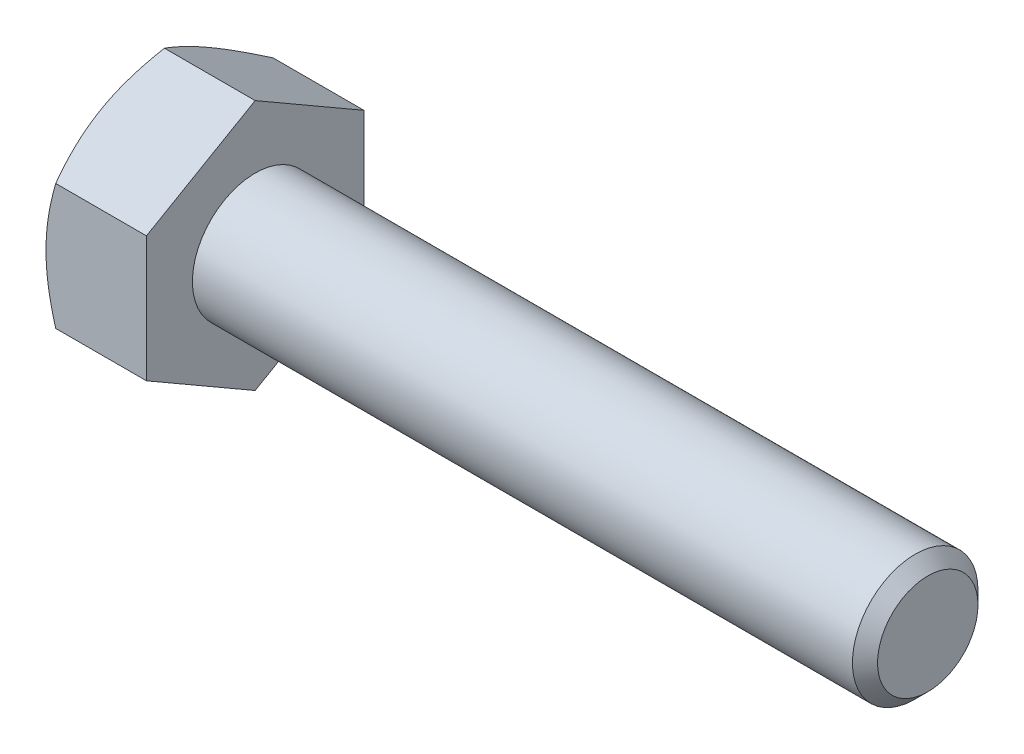
ISO-10303-21;
HEADER;
FILE_DESCRIPTION(('STEP AP214'),'2;1');
FILE_NAME('part.step','',(''),(''),'','','');
FILE_SCHEMA(('AUTOMOTIVE_DESIGN { 1 0 10303 214 1 1 1 1 }'));
ENDSEC;
DATA;
#1=APPLICATION_CONTEXT('core data for automotive mechanical design processes');
#2=APPLICATION_PROTOCOL_DEFINITION('international standard','automotive_design',2000,#1);
#3=PRODUCT_CONTEXT('',#1,'mechanical');
#4=PRODUCT('Part','Part','',(#3));
#5=PRODUCT_RELATED_PRODUCT_CATEGORY('part','',(#4));
#6=PRODUCT_DEFINITION_FORMATION('','',#4);
#7=PRODUCT_DEFINITION_CONTEXT('part definition',#1,'design');
#8=PRODUCT_DEFINITION('design','',#6,#7);
#9=PRODUCT_DEFINITION_SHAPE('','',#8);
#10=(LENGTH_UNIT() NAMED_UNIT(*) SI_UNIT(.MILLI.,.METRE.));
#11=(NAMED_UNIT(*) PLANE_ANGLE_UNIT() SI_UNIT($,.RADIAN.));
#12=(NAMED_UNIT(*) SI_UNIT($,.STERADIAN.) SOLID_ANGLE_UNIT());
#13=UNCERTAINTY_MEASURE_WITH_UNIT(LENGTH_MEASURE(1.E-05),#10,'distance_accuracy_value','');
#14=(GEOMETRIC_REPRESENTATION_CONTEXT(3) GLOBAL_UNCERTAINTY_ASSIGNED_CONTEXT((#13)) GLOBAL_UNIT_ASSIGNED_CONTEXT((#10,
#11,#12)) REPRESENTATION_CONTEXT('',''));
#15=CARTESIAN_POINT('',(0.,0.,0.));
#16=DIRECTION('',(0.,0.,1.));
#17=DIRECTION('',(1.,0.,0.));
#18=AXIS2_PLACEMENT_3D('',#15,#16,#17);
#19=CARTESIAN_POINT('',(-22.4,14.0000000000003,-24.2487113059641));
#20=DIRECTION('',(0.,0.866025403784442,-0.499999999999995));
#21=DIRECTION('',(0.,0.499999999999995,0.866025403784442));
#22=AXIS2_PLACEMENT_3D('',#19,#20,#21);
#23=PLANE('',#22);
#24=DIRECTION('',(1.,0.,0.));
#25=VECTOR('',#24,1.);
#26=CARTESIAN_POINT('',(-22.4,14.0000000000003,-24.2487113059641));
#27=LINE('',#26,#25);
#28=CARTESIAN_POINT('',(-20.2341924626905,14.0000000000003,-24.2487113059641));
#29=VERTEX_POINT('',#28);
#30=CARTESIAN_POINT('',(0.,14.0000000000003,-24.2487113059641));
#31=VERTEX_POINT('',#30);
#32=EDGE_CURVE('E252',#29,#31,#27,.T.);
#33=ORIENTED_EDGE('',*,*,#32,.F.);
#34=CARTESIAN_POINT('',(-20.2341257956115,13.9998845299464,-24.2489113059641));
#35=CARTESIAN_POINT('',(-20.4117715122077,14.3075984283394,-23.7159351997524));
#36=CARTESIAN_POINT('',(-20.5813558812323,14.6165125747592,-23.1808802029765));
#37=CARTESIAN_POINT('',(-20.9021611670325,15.2368179880883,-22.1064797108805));
#38=CARTESIAN_POINT('',(-21.0533760441204,15.548210034041,-21.5671328662175));
#39=CARTESIAN_POINT('',(-21.3354126870703,16.1740796969398,-20.4830948111608));
#40=CARTESIAN_POINT('',(-21.4661857530953,16.4885628407734,-19.9383940279171));
#41=CARTESIAN_POINT('',(-21.7045216201313,17.1197009755411,-18.8452307119051));
#42=CARTESIAN_POINT('',(-21.8120867333113,17.4363557468734,-18.2967685594983));
#43=CARTESIAN_POINT('',(-21.999440715812,18.0637431840257,-17.2101016423202));
#44=CARTESIAN_POINT('',(-22.0798491651022,18.3744293133949,-16.6719774810458));
#45=CARTESIAN_POINT('',(-22.2146757504761,18.9972251570854,-15.5932634370311));
#46=CARTESIAN_POINT('',(-22.2690933862722,19.3093348986926,-15.0526735070303));
#47=CARTESIAN_POINT('',(-22.3505643267743,19.934078664347,-13.9705855632049));
#48=CARTESIAN_POINT('',(-22.3776501480684,20.2467116211191,-13.4290893979552));
#49=CARTESIAN_POINT('',(-22.4038749857901,20.8722660354199,-12.3455973694871));
#50=CARTESIAN_POINT('',(-22.403014865806,21.1851874837349,-11.8036015222275));
#51=CARTESIAN_POINT('',(-22.3752997453254,21.7701988915533,-10.7903320408787));
#52=CARTESIAN_POINT('',(-22.3518243592417,22.0423305167844,-10.3189862396321));
#53=CARTESIAN_POINT('',(-22.2841837977756,22.5859440881159,-9.37741991440191));
#54=CARTESIAN_POINT('',(-22.2400189187352,22.8574260434657,-8.90719937439788));
#55=CARTESIAN_POINT('',(-22.1317647934641,23.3996399708941,-7.96805730352053));
#56=CARTESIAN_POINT('',(-22.0676575302786,23.6703710405373,-7.49913733571097));
#57=CARTESIAN_POINT('',(-21.9206532241075,24.2105368731294,-6.56354266914868));
#58=CARTESIAN_POINT('',(-21.8377562607311,24.4799716415656,-6.09686796089168));
#59=CARTESIAN_POINT('',(-21.5587533999874,25.2979182001452,-4.68014296355569));
#60=CARTESIAN_POINT('',(-21.3348126508562,25.8441060616358,-3.73411783697658));
#61=CARTESIAN_POINT('',(-20.9535640715387,26.6573560374759,-2.32552755956721));
#62=CARTESIAN_POINT('',(-20.819062159698,26.9272010251722,-1.85814233070956));
#63=CARTESIAN_POINT('',(-20.5364416826739,27.4650245230911,-0.926604706809592));
#64=CARTESIAN_POINT('',(-20.3883269553526,27.7330035366072,-0.462451440037495));
#65=CARTESIAN_POINT('',(-20.2341257956115,28.0001154700538,0.000200000000001955));
#66=B_SPLINE_CURVE_WITH_KNOTS('',3,(#34,#35,#36,#37,#38,#39,#40,#41,#42,#43,#44,#45,#46,#47,#48,
#49,#50,#51,#52,#53,#54,#55,#56,#57,#58,#59,#60,#61,#62,#63,#64,#65),.UNSPECIFIED.,.F.,.F.,(4,2,
2,2,2,2,2,2,2,2,2,2,2,2,2,4),(0.,1.92171215166389,3.84405444089411,5.77090885478266,
7.69757121069059,9.57671951619777,11.455903991291,13.3328501603323,15.2097383278453,
16.8436515929556,18.4775414557296,20.1129117651699,21.7482751459166,25.0910368365272,
26.7595060192956,28.4275062449903),.UNSPECIFIED.);
#67=CARTESIAN_POINT('',(-22.4,21.0000000000001,-12.124355652982));
#68=VERTEX_POINT('',#67);
#69=EDGE_CURVE('E131',#29,#68,#66,.T.);
#70=ORIENTED_EDGE('',*,*,#69,.T.);
#71=CARTESIAN_POINT('',(-20.2341924626905,28.,0.));
#72=VERTEX_POINT('',#71);
#73=EDGE_CURVE('E70',#68,#72,#66,.T.);
#74=ORIENTED_EDGE('',*,*,#73,.T.);
#75=DIRECTION('',(1.,0.,0.));
#76=VECTOR('',#75,1.);
#77=CARTESIAN_POINT('',(-22.4,28.,0.));
#78=LINE('',#77,#76);
#79=CARTESIAN_POINT('',(0.,28.,0.));
#80=VERTEX_POINT('',#79);
#81=EDGE_CURVE('E260',#72,#80,#78,.T.);
#82=ORIENTED_EDGE('',*,*,#81,.T.);
#83=DIRECTION('',(0.,0.499999999999995,0.866025403784441));
#84=VECTOR('',#83,1.);
#85=CARTESIAN_POINT('',(0.,14.0000000000003,-24.2487113059641));
#86=LINE('',#85,#84);
#87=EDGE_CURVE('E339',#31,#80,#86,.T.);
#88=ORIENTED_EDGE('',*,*,#87,.F.);
#89=EDGE_LOOP('',(#33,#70,#74,#82,#88));
#90=FACE_BOUND('',#89,.T.);
#91=ADVANCED_FACE('F52',(#90),#23,.T.);
#92=CARTESIAN_POINT('',(-22.4,-13.9999999999997,-24.2487113059644));
#93=DIRECTION('',(0.,0.,-1.));
#94=DIRECTION('',(0.,1.,0.));
#95=AXIS2_PLACEMENT_3D('',#92,#93,#94);
#96=PLANE('',#95);
#97=DIRECTION('',(1.,0.,0.));
#98=VECTOR('',#97,1.);
#99=CARTESIAN_POINT('',(-22.4,-13.9999999999997,-24.2487113059644));
#100=LINE('',#99,#98);
#101=CARTESIAN_POINT('',(-20.2341924626905,-13.9999999999997,-24.2487113059644));
#102=VERTEX_POINT('',#101);
#103=CARTESIAN_POINT('',(0.,-13.9999999999997,-24.2487113059644));
#104=VERTEX_POINT('',#103);
#105=EDGE_CURVE('E156',#102,#104,#100,.T.);
#106=ORIENTED_EDGE('',*,*,#105,.F.);
#107=CARTESIAN_POINT('',(-4.39067936018353,-49.8576957296237,-24.2487113059647));
#108=CARTESIAN_POINT('',(-4.69211693665287,-49.2771091719674,-24.2487113059647));
#109=CARTESIAN_POINT('',(-4.99276592450875,-48.6961132731675,-24.2487113059647));
#110=CARTESIAN_POINT('',(-5.59232411639471,-47.5332225016163,-24.2487113059647));
#111=CARTESIAN_POINT('',(-5.89123331549257,-46.9513276263224,-24.2487113059647));
#112=CARTESIAN_POINT('',(-6.78513028614737,-45.204129146814,-24.2487113059647));
#113=CARTESIAN_POINT('',(-7.37726158062082,-44.0373614110235,-24.2487113059647));
#114=CARTESIAN_POINT('',(-8.55319291905139,-41.6973201218416,-24.2487113059647));
#115=CARTESIAN_POINT('',(-9.13697832510602,-40.5240392029916,-24.2487113059646));
#116=CARTESIAN_POINT('',(-10.2931002719574,-38.1718662285001,-24.2487113059646));
#117=CARTESIAN_POINT('',(-10.8654369890625,-36.9929742596148,-24.2487113059646));
#118=CARTESIAN_POINT('',(-12.0272051177421,-34.5628401510866,-24.2487113059646));
#119=CARTESIAN_POINT('',(-12.6158261874657,-33.3112090202652,-24.2487113059646));
#120=CARTESIAN_POINT('',(-13.4835205215017,-31.4267090909337,-24.2487113059645));
#121=CARTESIAN_POINT('',(-13.7702202331719,-30.7973491930455,-24.2487113059645));
#122=CARTESIAN_POINT('',(-14.3378143020981,-29.53601911421,-24.2487113059645));
#123=CARTESIAN_POINT('',(-14.6187087041632,-28.9040489534555,-24.2487113059645));
#124=CARTESIAN_POINT('',(-15.173728843207,-27.6375400269457,-24.2487113059645));
#125=CARTESIAN_POINT('',(-15.4478580949411,-27.0030028032082,-24.2487113059645));
#126=CARTESIAN_POINT('',(-15.9885325850385,-25.7307105871587,-24.2487113059645));
#127=CARTESIAN_POINT('',(-16.2550779224889,-25.0929556370161,-24.2487113059645));
#128=CARTESIAN_POINT('',(-16.7794360655815,-23.8139112979848,-24.2487113059645));
#129=CARTESIAN_POINT('',(-17.0372494805769,-23.1726221593744,-24.2487113059645));
#130=CARTESIAN_POINT('',(-17.5428230080651,-21.8861014901176,-24.2487113059645));
#131=CARTESIAN_POINT('',(-17.7905833231343,-21.240870039213,-24.2487113059644));
#132=CARTESIAN_POINT('',(-18.3054191277423,-19.8633184854144,-24.2487113059644));
#133=CARTESIAN_POINT('',(-18.5709167740747,-19.1304063718083,-24.2487113059644));
#134=CARTESIAN_POINT('',(-19.0845111242622,-17.6584892983163,-24.2487113059644));
#135=CARTESIAN_POINT('',(-19.3326078682463,-16.9194843524858,-24.2487113059644));
#136=CARTESIAN_POINT('',(-19.8083394765718,-15.4347344905315,-24.2487113059644));
#137=CARTESIAN_POINT('',(-20.0359705413085,-14.6889883510232,-24.2487113059644));
#138=CARTESIAN_POINT('',(-20.4671404527943,-13.1905223760212,-24.2487113059644));
#139=CARTESIAN_POINT('',(-20.6706793358478,-12.4378025510379,-24.2487113059643));
#140=CARTESIAN_POINT('',(-21.0458604086984,-10.9404928941336,-24.2487113059643));
#141=CARTESIAN_POINT('',(-21.2180619039079,-10.1960441419507,-24.2487113059643));
#142=CARTESIAN_POINT('',(-21.5315035844664,-8.70067099718992,-24.2487113059643));
#143=CARTESIAN_POINT('',(-21.6727464844092,-7.94974717838197,-24.2487113059643));
#144=CARTESIAN_POINT('',(-21.9203155176297,-6.44246189471173,-24.2487113059643));
#145=CARTESIAN_POINT('',(-22.0266575308799,-5.68610306332449,-24.2487113059643));
#146=CARTESIAN_POINT('',(-22.2010825790426,-4.16895176584101,-24.2487113059643));
#147=CARTESIAN_POINT('',(-22.2691661796888,-3.40815936547282,-24.2487113059643));
#148=CARTESIAN_POINT('',(-22.3653670331528,-1.87205766740854,-24.2487113059642));
#149=CARTESIAN_POINT('',(-22.3928418431449,-1.09670758046426,-24.2487113059642));
#150=CARTESIAN_POINT('',(-22.404701974427,0.454323936163189,-24.2487113059642));
#151=CARTESIAN_POINT('',(-22.3890873524842,1.23000536540849,-24.2487113059642));
#152=CARTESIAN_POINT('',(-22.3153846442478,2.77949356639692,-24.2487113059642));
#153=CARTESIAN_POINT('',(-22.2572872708929,3.5532998911112,-24.2487113059642));
#154=CARTESIAN_POINT('',(-22.1008171942907,5.09680212303927,-24.2487113059642));
#155=CARTESIAN_POINT('',(-22.002443430299,5.86649792145474,-24.2487113059642));
#156=CARTESIAN_POINT('',(-21.7663431940247,7.41635955505859,-24.2487113059641));
#157=CARTESIAN_POINT('',(-21.6278318701192,8.19640468878985,-24.2487113059641));
#158=CARTESIAN_POINT('',(-21.3166332046625,9.74959478243531,-24.2487113059641));
#159=CARTESIAN_POINT('',(-21.1439453317849,10.5227396348788,-24.2487113059641));
#160=CARTESIAN_POINT('',(-20.7687936054352,12.0619606735685,-24.2487113059641));
#161=CARTESIAN_POINT('',(-20.5663208504047,12.8280346736155,-24.2487113059641));
#162=CARTESIAN_POINT('',(-20.1358829639483,14.3529432324453,-24.2487113059641));
#163=CARTESIAN_POINT('',(-19.9079177519063,15.1117777683263,-24.2487113059641));
#164=CARTESIAN_POINT('',(-19.4274753622177,16.6315648399561,-24.248711305964));
#165=CARTESIAN_POINT('',(-19.174738451337,17.3924348512837,-24.248711305964));
#166=CARTESIAN_POINT('',(-18.650506052092,18.9077106875052,-24.248711305964));
#167=CARTESIAN_POINT('',(-18.3790093725799,19.6621160985059,-24.248711305964));
#168=CARTESIAN_POINT('',(-17.8201233826398,21.1652086879412,-24.248711305964));
#169=CARTESIAN_POINT('',(-17.5327301640038,21.9138944082207,-24.248711305964));
#170=CARTESIAN_POINT('',(-16.9445645763258,23.4059601288475,-24.248711305964));
#171=CARTESIAN_POINT('',(-16.6437924703517,24.1493402331856,-24.248711305964));
#172=CARTESIAN_POINT('',(-16.0305007867287,25.6323534424406,-24.248711305964));
#173=CARTESIAN_POINT('',(-15.7179665270511,26.3719804620487,-24.2487113059639));
#174=CARTESIAN_POINT('',(-15.0832067810466,27.8470598327531,-24.2487113059639));
#175=CARTESIAN_POINT('',(-14.7609812563372,28.5825121673018,-24.2487113059639));
#176=CARTESIAN_POINT('',(-14.1082877372452,30.049623904037,-24.2487113059639));
#177=CARTESIAN_POINT('',(-13.777820881347,30.7812838134388,-24.2487113059639));
#178=CARTESIAN_POINT('',(-13.1097603749729,32.2413358138537,-24.2487113059639));
#179=CARTESIAN_POINT('',(-12.7721667392065,32.9697279116077,-24.2487113059639));
#180=CARTESIAN_POINT('',(-11.7919601500918,35.0614316704352,-24.2487113059639));
#181=CARTESIAN_POINT('',(-11.1415996010563,36.4211135810542,-24.2487113059638));
#182=CARTESIAN_POINT('',(-9.8242468667636,39.132433107234,-24.2487113059638));
#183=CARTESIAN_POINT('',(-9.15725403092554,40.4840704055559,-24.2487113059638));
#184=CARTESIAN_POINT('',(-8.14824804826902,42.5040864345177,-24.2487113059638));
#185=CARTESIAN_POINT('',(-7.81113971041974,43.1749216402652,-24.2487113059638));
#186=CARTESIAN_POINT('',(-7.13402704991872,44.5151301761616,-24.2487113059638));
#187=CARTESIAN_POINT('',(-6.79402272433621,45.1845035048303,-24.2487113059637));
#188=CARTESIAN_POINT('',(-6.11146208443256,46.521869503029,-24.2487113059637));
#189=CARTESIAN_POINT('',(-5.76890600714949,47.1898622936146,-24.2487113059637));
#190=CARTESIAN_POINT('',(-5.08147079905395,48.5246477953164,-24.2487113059637));
#191=CARTESIAN_POINT('',(-4.73659167886034,49.1914405119006,-24.2487113059637));
#192=CARTESIAN_POINT('',(-4.39067936018352,49.8576957296242,-24.2487113059637));
#193=B_SPLINE_CURVE_WITH_KNOTS('',3,(#107,#108,#109,#110,#111,#112,#113,#114,#115,#116,#117,
#118,#119,#120,#121,#122,#123,#124,#125,#126,#127,#128,#129,#130,#131,#132,#133,#134,#135,#136,
#137,#138,#139,#140,#141,#142,#143,#144,#145,#146,#147,#148,#149,#150,#151,#152,#153,#154,#155,
#156,#157,#158,#159,#160,#161,#162,#163,#164,#165,#166,#167,#168,#169,#170,#171,#172,#173,#174,
#175,#176,#177,#178,#179,#180,#181,#182,#183,#184,#185,#186,#187,#188,#189,#190,#191,#192),
.UNSPECIFIED.,.F.,.F.,(4,2,2,2,2,2,2,2,2,2,2,2,2,2,2,2,2,2,2,2,2,2,2,2,2,2,2,2,2,2,2,2,2,2,2,2,
2,2,2,2,2,2,4),(0.,1.96252492726372,3.92505541548178,7.85028451019962,11.7817140549161,
15.7130830094708,19.8623172615306,21.9370505437125,24.0117678058105,26.0853834585914,
28.1589720062231,30.232415550013,32.3058172918551,34.6441853093146,36.9825479339702,
39.3213438003051,41.6601361422751,43.9518779593341,46.2434187453434,48.5339154255544,
50.8243782349008,53.1507027982297,55.4770242967941,57.8038544995001,60.1307459870175,
62.5066229530603,64.8825368586181,67.2591622817224,69.6357952207583,72.0407503194116,
74.4458582607953,76.8515601557443,79.2572147684496,81.6659788823197,84.0747525374077,
86.4831952600459,88.8916330122541,93.4131199712176,97.9347840688838,100.187100921072,
102.439420052902,104.691532507813,106.943634675072),.UNSPECIFIED.);
#194=CARTESIAN_POINT('',(-22.4,2.52388852587843E-13,-24.2487113059643));
#195=VERTEX_POINT('',#194);
#196=EDGE_CURVE('E136',#102,#195,#193,.T.);
#197=ORIENTED_EDGE('',*,*,#196,.T.);
#198=EDGE_CURVE('E125',#195,#29,#193,.T.);
#199=ORIENTED_EDGE('',*,*,#198,.T.);
#200=ORIENTED_EDGE('',*,*,#32,.T.);
#201=DIRECTION('',(0.,1.,0.));
#202=VECTOR('',#201,1.);
#203=CARTESIAN_POINT('',(0.,-13.9999999999997,-24.2487113059644));
#204=LINE('',#203,#202);
#205=EDGE_CURVE('E263',#104,#31,#204,.T.);
#206=ORIENTED_EDGE('',*,*,#205,.F.);
#207=EDGE_LOOP('',(#106,#197,#199,#200,#206));
#208=FACE_BOUND('',#207,.T.);
#209=ADVANCED_FACE('F154',(#208),#96,.T.);
#210=CARTESIAN_POINT('',(-22.4,-28.,-1.95522954975215E-13));
#211=DIRECTION('',(0.,-0.866025403784435,-0.500000000000007));
#212=DIRECTION('',(0.,0.500000000000007,-0.866025403784435));
#213=AXIS2_PLACEMENT_3D('',#210,#211,#212);
#214=PLANE('',#213);
#215=DIRECTION('',(1.,0.,0.));
#216=VECTOR('',#215,1.);
#217=CARTESIAN_POINT('',(-22.4,-28.,-1.95522954975215E-13));
#218=LINE('',#217,#216);
#219=CARTESIAN_POINT('',(-20.2341924626905,-28.,-1.95955437504307E-13));
#220=VERTEX_POINT('',#219);
#221=CARTESIAN_POINT('',(0.,-28.,-1.95522954975215E-13));
#222=VERTEX_POINT('',#221);
#223=EDGE_CURVE('E241',#220,#222,#218,.T.);
#224=ORIENTED_EDGE('',*,*,#223,.F.);
#225=CARTESIAN_POINT('',(-20.2341257956115,-28.0001154700538,0.000199999999804485));
#226=CARTESIAN_POINT('',(-20.4117715122077,-27.6924015716608,-0.532776106211868));
#227=CARTESIAN_POINT('',(-20.5813558812323,-27.383487425241,-1.06783110298778));
#228=CARTESIAN_POINT('',(-20.9021611670325,-26.7631820119119,-2.14223159508375));
#229=CARTESIAN_POINT('',(-21.0533760441204,-26.4517899659592,-2.68157843974674));
#230=CARTESIAN_POINT('',(-21.3354126870704,-25.8259203030604,-3.76561649480344));
#231=CARTESIAN_POINT('',(-21.4661857530953,-25.5114371592268,-4.31031727804717));
#232=CARTESIAN_POINT('',(-21.7045216201313,-24.880299024459,-5.40348059405917));
#233=CARTESIAN_POINT('',(-21.8120867333113,-24.5636442531267,-5.95194274646589));
#234=CARTESIAN_POINT('',(-21.999440715812,-23.9362568159744,-7.03860966364397));
#235=CARTESIAN_POINT('',(-22.0798491651022,-23.6255706866052,-7.57673382491837));
#236=CARTESIAN_POINT('',(-22.2146757504761,-23.0027748429147,-8.65544786893307));
#237=CARTESIAN_POINT('',(-22.2690933862722,-22.6906651013075,-9.19603779893387));
#238=CARTESIAN_POINT('',(-22.3505643267743,-22.065921335653,-10.2781257427593));
#239=CARTESIAN_POINT('',(-22.3776501480684,-21.753288378881,-10.819621908009));
#240=CARTESIAN_POINT('',(-22.4038749857901,-21.1277339645801,-11.903113936477));
#241=CARTESIAN_POINT('',(-22.4030148658061,-20.8148125162651,-12.4451097837366));
#242=CARTESIAN_POINT('',(-22.3752997453254,-20.2298011084467,-13.4583792650855));
#243=CARTESIAN_POINT('',(-22.3518243592418,-19.9576694832156,-13.9297250663321));
#244=CARTESIAN_POINT('',(-22.2841837977756,-19.4140559118841,-14.8712913915623));
#245=CARTESIAN_POINT('',(-22.2400189187353,-19.1425739565342,-15.3415119315663));
#246=CARTESIAN_POINT('',(-22.1317647934642,-18.6003600291059,-16.2806540024437));
#247=CARTESIAN_POINT('',(-22.0676575302787,-18.3296289594626,-16.7495739702533));
#248=CARTESIAN_POINT('',(-21.9206532241076,-17.7894631268705,-17.6851686368156));
#249=CARTESIAN_POINT('',(-21.8377562607311,-17.5200283584343,-18.1518433450726));
#250=CARTESIAN_POINT('',(-21.5587533999875,-16.7020817998547,-19.5685683424086));
#251=CARTESIAN_POINT('',(-21.3348126508563,-16.155893938364,-20.5145934689877));
#252=CARTESIAN_POINT('',(-20.9535640715388,-15.3426439625238,-21.9231837463971));
#253=CARTESIAN_POINT('',(-20.8190621596981,-15.0727989748276,-22.3905689752548));
#254=CARTESIAN_POINT('',(-20.5364416826739,-14.5349754769087,-23.3221065991548));
#255=CARTESIAN_POINT('',(-20.3883269553526,-14.2669964633925,-23.7862598659269));
#256=CARTESIAN_POINT('',(-20.2341257956115,-13.9998845299459,-24.2489113059644));
#257=B_SPLINE_CURVE_WITH_KNOTS('',3,(#225,#226,#227,#228,#229,#230,#231,#232,#233,#234,#235,
#236,#237,#238,#239,#240,#241,#242,#243,#244,#245,#246,#247,#248,#249,#250,#251,#252,#253,#254,
#255,#256),.UNSPECIFIED.,.F.,.F.,(4,2,2,2,2,2,2,2,2,2,2,2,2,2,2,4),(0.,1.92171215166388,
3.84405444089411,5.77090885478266,7.69757121069059,9.57671951619778,11.455903991291,
13.3328501603323,15.2097383278453,16.8436515929556,18.4775414557297,20.1129117651701,
21.7482751459167,25.0910368365275,26.7595060192959,28.4275062449906),.UNSPECIFIED.);
#258=CARTESIAN_POINT('',(-22.4,-20.9999999999999,-12.1243556529823));
#259=VERTEX_POINT('',#258);
#260=EDGE_CURVE('E242',#220,#259,#257,.T.);
#261=ORIENTED_EDGE('',*,*,#260,.T.);
#262=EDGE_CURVE('E144',#259,#102,#257,.T.);
#263=ORIENTED_EDGE('',*,*,#262,.T.);
#264=ORIENTED_EDGE('',*,*,#105,.T.);
#265=DIRECTION('',(0.,0.500000000000007,-0.866025403784435));
#266=VECTOR('',#265,1.);
#267=CARTESIAN_POINT('',(0.,-28.,-1.95522954975215E-13));
#268=LINE('',#267,#266);
#269=EDGE_CURVE('E244',#222,#104,#268,.T.);
#270=ORIENTED_EDGE('',*,*,#269,.F.);
#271=EDGE_LOOP('',(#224,#261,#263,#264,#270));
#272=FACE_BOUND('',#271,.T.);
#273=ADVANCED_FACE('F231',(#272),#214,.T.);
#274=CARTESIAN_POINT('',(-22.4,-14.0000000000001,24.2487113059642));
#275=DIRECTION('',(0.,-0.866025403784442,0.499999999999995));
#276=DIRECTION('',(0.,-0.499999999999995,-0.866025403784442));
#277=AXIS2_PLACEMENT_3D('',#274,#275,#276);
#278=PLANE('',#277);
#279=DIRECTION('',(1.,0.,0.));
#280=VECTOR('',#279,1.);
#281=CARTESIAN_POINT('',(-22.4,-14.0000000000001,24.2487113059642));
#282=LINE('',#281,#280);
#283=CARTESIAN_POINT('',(-20.2341924626905,-14.0000000000001,24.2487113059642));
#284=VERTEX_POINT('',#283);
#285=CARTESIAN_POINT('',(0.,-14.0000000000001,24.2487113059642));
#286=VERTEX_POINT('',#285);
#287=EDGE_CURVE('E248',#284,#286,#282,.T.);
#288=ORIENTED_EDGE('',*,*,#287,.F.);
#289=CARTESIAN_POINT('',(-20.2341257956115,-13.9998845299462,24.2489113059642));
#290=CARTESIAN_POINT('',(-20.4117715122077,-14.3075984283392,23.7159351997525));
#291=CARTESIAN_POINT('',(-20.5813558812323,-14.616512574759,23.1808802029766));
#292=CARTESIAN_POINT('',(-20.9021611670326,-15.2368179880881,22.1064797108806));
#293=CARTESIAN_POINT('',(-21.0533760441204,-15.5482100340408,21.5671328662176));
#294=CARTESIAN_POINT('',(-21.3354126870704,-16.1740796969396,20.4830948111609));
#295=CARTESIAN_POINT('',(-21.4661857530953,-16.4885628407732,19.9383940279172));
#296=CARTESIAN_POINT('',(-21.7045216201313,-17.1197009755409,18.8452307119052));
#297=CARTESIAN_POINT('',(-21.8120867333113,-17.4363557468733,18.2967685594984));
#298=CARTESIAN_POINT('',(-21.999440715812,-18.0637431840255,17.2101016423203));
#299=CARTESIAN_POINT('',(-22.0798491651022,-18.3744293133947,16.6719774810459));
#300=CARTESIAN_POINT('',(-22.2146757504761,-18.9972251570852,15.5932634370312));
#301=CARTESIAN_POINT('',(-22.2690933862722,-19.3093348986924,15.0526735070304));
#302=CARTESIAN_POINT('',(-22.3505643267743,-19.9340786643468,13.970585563205));
#303=CARTESIAN_POINT('',(-22.3776501480684,-20.2467116211189,13.4290893979553));
#304=CARTESIAN_POINT('',(-22.4038749857901,-20.8722660354197,12.3455973694873));
#305=CARTESIAN_POINT('',(-22.4030148658061,-21.1851874837347,11.8036015222276));
#306=CARTESIAN_POINT('',(-22.3752997453254,-21.7701988915531,10.7903320408788));
#307=CARTESIAN_POINT('',(-22.3518243592418,-22.0423305167843,10.3189862396321));
#308=CARTESIAN_POINT('',(-22.2841837977756,-22.5859440881158,9.37741991440196));
#309=CARTESIAN_POINT('',(-22.2400189187353,-22.8574260434656,8.90719937439792));
#310=CARTESIAN_POINT('',(-22.1317647934642,-23.3996399708939,7.96805730352055));
#311=CARTESIAN_POINT('',(-22.0676575302787,-23.6703710405372,7.49913733571097));
#312=CARTESIAN_POINT('',(-21.9206532241076,-24.2105368731293,6.56354266914866));
#313=CARTESIAN_POINT('',(-21.8377562607311,-24.4799716415655,6.09686796089164));
#314=CARTESIAN_POINT('',(-21.5587533999875,-25.2979182001451,4.68014296355562));
#315=CARTESIAN_POINT('',(-21.3348126508563,-25.8441060616357,3.73411783697649));
#316=CARTESIAN_POINT('',(-20.9535640715388,-26.6573560374759,2.32552755956709));
#317=CARTESIAN_POINT('',(-20.8190621596981,-26.9272010251721,1.85814233070941));
#318=CARTESIAN_POINT('',(-20.5364416826739,-27.465024523091,0.926604706809424));
#319=CARTESIAN_POINT('',(-20.3883269553526,-27.7330035366072,0.462451440037314));
#320=CARTESIAN_POINT('',(-20.2341257956115,-28.0001154700538,-0.000200000000192907));
#321=B_SPLINE_CURVE_WITH_KNOTS('',3,(#289,#290,#291,#292,#293,#294,#295,#296,#297,#298,#299,
#300,#301,#302,#303,#304,#305,#306,#307,#308,#309,#310,#311,#312,#313,#314,#315,#316,#317,#318,
#319,#320),.UNSPECIFIED.,.F.,.F.,(4,2,2,2,2,2,2,2,2,2,2,2,2,2,2,4),(0.,1.92171215166389,
3.84405444089411,5.77090885478267,7.69757121069059,9.57671951619778,11.455903991291,
13.3328501603323,15.2097383278453,16.8436515929556,18.4775414557297,20.1129117651701,
21.7482751459167,25.0910368365275,26.7595060192959,28.4275062449906),.UNSPECIFIED.);
#322=CARTESIAN_POINT('',(-22.4,-21.0000000000001,12.124355652982));
#323=VERTEX_POINT('',#322);
#324=EDGE_CURVE('E137',#284,#323,#321,.T.);
#325=ORIENTED_EDGE('',*,*,#324,.T.);
#326=EDGE_CURVE('E158',#323,#220,#321,.T.);
#327=ORIENTED_EDGE('',*,*,#326,.T.);
#328=ORIENTED_EDGE('',*,*,#223,.T.);
#329=DIRECTION('',(0.,-0.499999999999995,-0.866025403784442));
#330=VECTOR('',#329,1.);
#331=CARTESIAN_POINT('',(0.,-14.0000000000001,24.2487113059642));
#332=LINE('',#331,#330);
#333=EDGE_CURVE('E333',#286,#222,#332,.T.);
#334=ORIENTED_EDGE('',*,*,#333,.F.);
#335=EDGE_LOOP('',(#288,#325,#327,#328,#334));
#336=FACE_BOUND('',#335,.T.);
#337=ADVANCED_FACE('F227',(#336),#278,.T.);
#338=CARTESIAN_POINT('',(-22.4,13.9999999999999,24.2487113059643));
#339=DIRECTION('',(0.,0.,1.));
#340=DIRECTION('',(0.,-1.,0.));
#341=AXIS2_PLACEMENT_3D('',#338,#339,#340);
#342=PLANE('',#341);
#343=DIRECTION('',(1.,0.,0.));
#344=VECTOR('',#343,1.);
#345=CARTESIAN_POINT('',(-22.4,13.9999999999999,24.2487113059643));
#346=LINE('',#345,#344);
#347=CARTESIAN_POINT('',(-20.2341924626905,13.9999999999999,24.2487113059643));
#348=VERTEX_POINT('',#347);
#349=CARTESIAN_POINT('',(0.,13.9999999999999,24.2487113059643));
#350=VERTEX_POINT('',#349);
#351=EDGE_CURVE('E254',#348,#350,#346,.T.);
#352=ORIENTED_EDGE('',*,*,#351,.F.);
#353=CARTESIAN_POINT('',(-4.39067936018353,49.8576957296239,24.2487113059644));
#354=CARTESIAN_POINT('',(-4.69211693665287,49.2771091719675,24.2487113059644));
#355=CARTESIAN_POINT('',(-4.99276592450875,48.6961132731676,24.2487113059644));
#356=CARTESIAN_POINT('',(-5.59232411639471,47.5332225016165,24.2487113059644));
#357=CARTESIAN_POINT('',(-5.89123331549257,46.9513276263226,24.2487113059644));
#358=CARTESIAN_POINT('',(-6.78513028614737,45.2041291468142,24.2487113059644));
#359=CARTESIAN_POINT('',(-7.37726158062082,44.0373614110237,24.2487113059644));
#360=CARTESIAN_POINT('',(-8.55319291905139,41.6973201218418,24.2487113059644));
#361=CARTESIAN_POINT('',(-9.13697832510602,40.5240392029917,24.2487113059644));
#362=CARTESIAN_POINT('',(-10.2931002719574,38.1718662285003,24.2487113059644));
#363=CARTESIAN_POINT('',(-10.8654369890625,36.992974259615,24.2487113059644));
#364=CARTESIAN_POINT('',(-12.0272051177421,34.5628401510867,24.2487113059643));
#365=CARTESIAN_POINT('',(-12.6158261874657,33.3112090202654,24.2487113059643));
#366=CARTESIAN_POINT('',(-13.4835205215017,31.4267090909339,24.2487113059643));
#367=CARTESIAN_POINT('',(-13.7702202331719,30.7973491930457,24.2487113059643));
#368=CARTESIAN_POINT('',(-14.3378143020981,29.5360191142101,24.2487113059643));
#369=CARTESIAN_POINT('',(-14.6187087041632,28.9040489534557,24.2487113059643));
#370=CARTESIAN_POINT('',(-15.173728843207,27.6375400269459,24.2487113059643));
#371=CARTESIAN_POINT('',(-15.4478580949411,27.0030028032084,24.2487113059643));
#372=CARTESIAN_POINT('',(-15.9885325850385,25.7307105871589,24.2487113059643));
#373=CARTESIAN_POINT('',(-16.2550779224889,25.0929556370162,24.2487113059643));
#374=CARTESIAN_POINT('',(-16.7794360655815,23.813911297985,24.2487113059643));
#375=CARTESIAN_POINT('',(-17.0372494805769,23.1726221593746,24.2487113059643));
#376=CARTESIAN_POINT('',(-17.5428230080651,21.8861014901178,24.2487113059643));
#377=CARTESIAN_POINT('',(-17.7905833231343,21.2408700392131,24.2487113059643));
#378=CARTESIAN_POINT('',(-18.3054191277423,19.8633184854146,24.2487113059643));
#379=CARTESIAN_POINT('',(-18.5709167740747,19.1304063718084,24.2487113059643));
#380=CARTESIAN_POINT('',(-19.0845111242622,17.6584892983164,24.2487113059643));
#381=CARTESIAN_POINT('',(-19.3326078682463,16.9194843524859,24.2487113059643));
#382=CARTESIAN_POINT('',(-19.8083394765718,15.4347344905317,24.2487113059643));
#383=CARTESIAN_POINT('',(-20.0359705413085,14.6889883510234,24.2487113059643));
#384=CARTESIAN_POINT('',(-20.4671404527943,13.1905223760213,24.2487113059643));
#385=CARTESIAN_POINT('',(-20.6706793358478,12.4378025510381,24.2487113059643));
#386=CARTESIAN_POINT('',(-21.0458604086984,10.9404928941337,24.2487113059643));
#387=CARTESIAN_POINT('',(-21.2180619039078,10.1960441419509,24.2487113059643));
#388=CARTESIAN_POINT('',(-21.5315035844664,8.70067099719009,24.2487113059643));
#389=CARTESIAN_POINT('',(-21.6727464844092,7.94974717838215,24.2487113059643));
#390=CARTESIAN_POINT('',(-21.9203155176297,6.44246189471191,24.2487113059642));
#391=CARTESIAN_POINT('',(-22.0266575308799,5.68610306332466,24.2487113059642));
#392=CARTESIAN_POINT('',(-22.2010825790426,4.16895176584118,24.2487113059642));
#393=CARTESIAN_POINT('',(-22.2691661796888,3.40815936547299,24.2487113059642));
#394=CARTESIAN_POINT('',(-22.3653670331528,1.87205766740871,24.2487113059642));
#395=CARTESIAN_POINT('',(-22.3928418431449,1.09670758046442,24.2487113059642));
#396=CARTESIAN_POINT('',(-22.404701974427,-0.454323936163021,24.2487113059642));
#397=CARTESIAN_POINT('',(-22.3890873524842,-1.23000536540832,24.2487113059642));
#398=CARTESIAN_POINT('',(-22.3153846442478,-2.77949356639675,24.2487113059642));
#399=CARTESIAN_POINT('',(-22.2572872708929,-3.55329989111103,24.2487113059642));
#400=CARTESIAN_POINT('',(-22.1008171942907,-5.0968021230391,24.2487113059642));
#401=CARTESIAN_POINT('',(-22.002443430299,-5.86649792145457,24.2487113059642));
#402=CARTESIAN_POINT('',(-21.7663431940246,-7.41635955505842,24.2487113059642));
#403=CARTESIAN_POINT('',(-21.6278318701192,-8.19640468878968,24.2487113059642));
#404=CARTESIAN_POINT('',(-21.3166332046625,-9.74959478243514,24.2487113059642));
#405=CARTESIAN_POINT('',(-21.1439453317849,-10.5227396348787,24.2487113059642));
#406=CARTESIAN_POINT('',(-20.7687936054352,-12.0619606735683,24.2487113059642));
#407=CARTESIAN_POINT('',(-20.5663208504047,-12.8280346736153,24.2487113059642));
#408=CARTESIAN_POINT('',(-20.1358829639483,-14.3529432324452,24.2487113059642));
#409=CARTESIAN_POINT('',(-19.9079177519063,-15.1117777683261,24.2487113059642));
#410=CARTESIAN_POINT('',(-19.4274753622177,-16.631564839956,24.2487113059642));
#411=CARTESIAN_POINT('',(-19.174738451337,-17.3924348512835,24.2487113059642));
#412=CARTESIAN_POINT('',(-18.650506052092,-18.907710687505,24.2487113059642));
#413=CARTESIAN_POINT('',(-18.3790093725799,-19.6621160985057,24.2487113059642));
#414=CARTESIAN_POINT('',(-17.8201233826398,-21.1652086879411,24.2487113059642));
#415=CARTESIAN_POINT('',(-17.5327301640038,-21.9138944082205,24.2487113059642));
#416=CARTESIAN_POINT('',(-16.9445645763258,-23.4059601288473,24.2487113059641));
#417=CARTESIAN_POINT('',(-16.6437924703517,-24.1493402331854,24.2487113059641));
#418=CARTESIAN_POINT('',(-16.0305007867287,-25.6323534424404,24.2487113059641));
#419=CARTESIAN_POINT('',(-15.7179665270511,-26.3719804620485,24.2487113059641));
#420=CARTESIAN_POINT('',(-15.0832067810466,-27.8470598327529,24.2487113059641));
#421=CARTESIAN_POINT('',(-14.7609812563372,-28.5825121673016,24.2487113059641));
#422=CARTESIAN_POINT('',(-14.1082877372452,-30.0496239040368,24.2487113059641));
#423=CARTESIAN_POINT('',(-13.777820881347,-30.7812838134386,24.2487113059641));
#424=CARTESIAN_POINT('',(-13.109760374973,-32.2413358138536,24.2487113059641));
#425=CARTESIAN_POINT('',(-12.7721667392065,-32.9697279116075,24.2487113059641));
#426=CARTESIAN_POINT('',(-11.7919601500918,-35.061431670435,24.2487113059641));
#427=CARTESIAN_POINT('',(-11.1415996010563,-36.421113581054,24.2487113059641));
#428=CARTESIAN_POINT('',(-9.82424686676361,-39.1324331072339,24.2487113059641));
#429=CARTESIAN_POINT('',(-9.15725403092555,-40.4840704055558,24.2487113059641));
#430=CARTESIAN_POINT('',(-8.14824804826902,-42.5040864345175,24.2487113059641));
#431=CARTESIAN_POINT('',(-7.81113971041975,-43.174921640265,24.2487113059641));
#432=CARTESIAN_POINT('',(-7.13402704991872,-44.5151301761615,24.2487113059641));
#433=CARTESIAN_POINT('',(-6.79402272433621,-45.1845035048301,24.2487113059641));
#434=CARTESIAN_POINT('',(-6.11146208443256,-46.5218695030288,24.2487113059641));
#435=CARTESIAN_POINT('',(-5.76890600714949,-47.1898622936145,24.2487113059641));
#436=CARTESIAN_POINT('',(-5.08147079905395,-48.5246477953163,24.2487113059641));
#437=CARTESIAN_POINT('',(-4.73659167886035,-49.1914405119005,24.2487113059641));
#438=CARTESIAN_POINT('',(-4.39067936018353,-49.857695729624,24.2487113059641));
#439=B_SPLINE_CURVE_WITH_KNOTS('',3,(#353,#354,#355,#356,#357,#358,#359,#360,#361,#362,#363,
#364,#365,#366,#367,#368,#369,#370,#371,#372,#373,#374,#375,#376,#377,#378,#379,#380,#381,#382,
#383,#384,#385,#386,#387,#388,#389,#390,#391,#392,#393,#394,#395,#396,#397,#398,#399,#400,#401,
#402,#403,#404,#405,#406,#407,#408,#409,#410,#411,#412,#413,#414,#415,#416,#417,#418,#419,#420,
#421,#422,#423,#424,#425,#426,#427,#428,#429,#430,#431,#432,#433,#434,#435,#436,#437,#438),
.UNSPECIFIED.,.F.,.F.,(4,2,2,2,2,2,2,2,2,2,2,2,2,2,2,2,2,2,2,2,2,2,2,2,2,2,2,2,2,2,2,2,2,2,2,2,
2,2,2,2,2,2,4),(0.,1.96252492726373,3.92505541548179,7.85028451019963,11.7817140549161,
15.7130830094708,19.8623172615306,21.9370505437125,24.0117678058105,26.0853834585914,
28.1589720062231,30.232415550013,32.3058172918551,34.6441853093146,36.9825479339702,
39.3213438003051,41.6601361422751,43.9518779593341,46.2434187453434,48.5339154255544,
50.8243782349008,53.1507027982297,55.4770242967941,57.8038544995001,60.1307459870175,
62.5066229530603,64.882536858618,67.2591622817223,69.6357952207583,72.0407503194116,
74.4458582607953,76.8515601557442,79.2572147684496,81.6659788823197,84.0747525374076,
86.4831952600458,88.8916330122541,93.4131199712176,97.9347840688838,100.187100921072,
102.439420052902,104.691532507813,106.943634675072),.UNSPECIFIED.);
#440=CARTESIAN_POINT('',(-22.4,0.,24.2487113059643));
#441=VERTEX_POINT('',#440);
#442=EDGE_CURVE('E205',#348,#441,#439,.T.);
#443=ORIENTED_EDGE('',*,*,#442,.T.);
#444=EDGE_CURVE('E309',#441,#284,#439,.T.);
#445=ORIENTED_EDGE('',*,*,#444,.T.);
#446=ORIENTED_EDGE('',*,*,#287,.T.);
#447=DIRECTION('',(0.,-1.,0.));
#448=VECTOR('',#447,1.);
#449=CARTESIAN_POINT('',(0.,13.9999999999999,24.2487113059643));
#450=LINE('',#449,#448);
#451=EDGE_CURVE('E329',#350,#286,#450,.T.);
#452=ORIENTED_EDGE('',*,*,#451,.F.);
#453=EDGE_LOOP('',(#352,#443,#445,#446,#452));
#454=FACE_BOUND('',#453,.T.);
#455=ADVANCED_FACE('F223',(#454),#342,.T.);
#456=CARTESIAN_POINT('',(-22.4,28.,0.));
#457=DIRECTION('',(0.,0.866025403784438,0.500000000000001));
#458=DIRECTION('',(0.,-0.500000000000001,0.866025403784438));
#459=AXIS2_PLACEMENT_3D('',#456,#457,#458);
#460=PLANE('',#459);
#461=ORIENTED_EDGE('',*,*,#81,.F.);
#462=CARTESIAN_POINT('',(-20.2341257956115,28.0001154700538,-0.000200000000000298));
#463=CARTESIAN_POINT('',(-20.4117715122077,27.6924015716608,0.532776106211674));
#464=CARTESIAN_POINT('',(-20.5813558812323,27.383487425241,1.06783110298759));
#465=CARTESIAN_POINT('',(-20.9021611670325,26.7631820119119,2.14223159508357));
#466=CARTESIAN_POINT('',(-21.0533760441204,26.4517899659592,2.68157843974656));
#467=CARTESIAN_POINT('',(-21.3354126870704,25.8259203030604,3.76561649480326));
#468=CARTESIAN_POINT('',(-21.4661857530953,25.5114371592268,4.31031727804699));
#469=CARTESIAN_POINT('',(-21.7045216201313,24.8802990244591,5.403480594059));
#470=CARTESIAN_POINT('',(-21.8120867333113,24.5636442531267,5.95194274646572));
#471=CARTESIAN_POINT('',(-21.999440715812,23.9362568159745,7.0386096636438));
#472=CARTESIAN_POINT('',(-22.0798491651022,23.6255706866053,7.57673382491821));
#473=CARTESIAN_POINT('',(-22.2146757504761,23.0027748429147,8.65544786893291));
#474=CARTESIAN_POINT('',(-22.2690933862722,22.6906651013076,9.19603779893371));
#475=CARTESIAN_POINT('',(-22.3505643267743,22.0659213356531,10.2781257427591));
#476=CARTESIAN_POINT('',(-22.3776501480684,21.7532883788811,10.8196219080088));
#477=CARTESIAN_POINT('',(-22.4038749857901,21.1277339645802,11.9031139364769));
#478=CARTESIAN_POINT('',(-22.4030148658061,20.8148125162652,12.4451097837365));
#479=CARTESIAN_POINT('',(-22.3752997453254,20.2298011084468,13.4583792650853));
#480=CARTESIAN_POINT('',(-22.3518243592418,19.9576694832157,13.929725066332));
#481=CARTESIAN_POINT('',(-22.2841837977756,19.4140559118842,14.8712913915622));
#482=CARTESIAN_POINT('',(-22.2400189187353,19.1425739565343,15.3415119315662));
#483=CARTESIAN_POINT('',(-22.1317647934642,18.600360029106,16.2806540024436));
#484=CARTESIAN_POINT('',(-22.0676575302787,18.3296289594627,16.7495739702531));
#485=CARTESIAN_POINT('',(-21.9206532241076,17.7894631268706,17.6851686368154));
#486=CARTESIAN_POINT('',(-21.8377562607311,17.5200283584344,18.1518433450725));
#487=CARTESIAN_POINT('',(-21.5587533999875,16.7020817998548,19.5685683424085));
#488=CARTESIAN_POINT('',(-21.3348126508563,16.1558939383642,20.5145934689876));
#489=CARTESIAN_POINT('',(-20.9535640715388,15.342643962524,21.923183746397));
#490=CARTESIAN_POINT('',(-20.8190621596981,15.0727989748277,22.3905689752547));
#491=CARTESIAN_POINT('',(-20.5364416826739,14.5349754769088,23.3221065991547));
#492=CARTESIAN_POINT('',(-20.3883269553526,14.2669964633927,23.7862598659268));
#493=CARTESIAN_POINT('',(-20.2341257956115,13.9998845299461,24.2489113059643));
#494=B_SPLINE_CURVE_WITH_KNOTS('',3,(#462,#463,#464,#465,#466,#467,#468,#469,#470,#471,#472,
#473,#474,#475,#476,#477,#478,#479,#480,#481,#482,#483,#484,#485,#486,#487,#488,#489,#490,#491,
#492,#493),.UNSPECIFIED.,.F.,.F.,(4,2,2,2,2,2,2,2,2,2,2,2,2,2,2,4),(0.,1.92171215166389,
3.84405444089411,5.77090885478267,7.6975712106906,9.57671951619779,11.455903991291,
13.3328501603323,15.2097383278453,16.8436515929556,18.4775414557297,20.1129117651701,
21.7482751459167,25.0910368365275,26.7595060192959,28.4275062449906),.UNSPECIFIED.);
#495=CARTESIAN_POINT('',(-22.4,21.,12.1243556529822));
#496=VERTEX_POINT('',#495);
#497=EDGE_CURVE('E318',#72,#496,#494,.T.);
#498=ORIENTED_EDGE('',*,*,#497,.T.);
#499=EDGE_CURVE('E77',#496,#348,#494,.T.);
#500=ORIENTED_EDGE('',*,*,#499,.T.);
#501=ORIENTED_EDGE('',*,*,#351,.T.);
#502=DIRECTION('',(0.,-0.500000000000001,0.866025403784438));
#503=VECTOR('',#502,1.);
#504=CARTESIAN_POINT('',(0.,28.,0.));
#505=LINE('',#504,#503);
#506=EDGE_CURVE('E334',#80,#350,#505,.T.);
#507=ORIENTED_EDGE('',*,*,#506,.F.);
#508=EDGE_LOOP('',(#461,#498,#500,#501,#507));
#509=FACE_BOUND('',#508,.T.);
#510=ADVANCED_FACE('F219',(#509),#460,.T.);
#511=CARTESIAN_POINT('',(0.,0.,0.));
#512=DIRECTION('',(1.,0.,0.));
#513=DIRECTION('',(0.,0.,-1.));
#514=AXIS2_PLACEMENT_3D('',#511,#512,#513);
#515=PLANE('',#514);
#516=CARTESIAN_POINT('',(0.,0.,0.));
#517=DIRECTION('',(1.,0.,0.));
#518=DIRECTION('',(0.,0.,-1.));
#519=AXIS2_PLACEMENT_3D('',#516,#517,#518);
#520=CIRCLE('',#519,14.);
#521=CARTESIAN_POINT('',(0.,0.,-14.));
#522=VERTEX_POINT('',#521);
#523=EDGE_CURVE('E267',#522,#522,#520,.T.);
#524=ORIENTED_EDGE('',*,*,#523,.F.);
#525=EDGE_LOOP('',(#524));
#526=FACE_BOUND('',#525,.T.);
#527=ORIENTED_EDGE('',*,*,#87,.T.);
#528=ORIENTED_EDGE('',*,*,#506,.T.);
#529=ORIENTED_EDGE('',*,*,#451,.T.);
#530=ORIENTED_EDGE('',*,*,#333,.T.);
#531=ORIENTED_EDGE('',*,*,#269,.T.);
#532=ORIENTED_EDGE('',*,*,#205,.T.);
#533=EDGE_LOOP('',(#527,#528,#529,#530,#531,#532));
#534=FACE_BOUND('',#533,.T.);
#535=ADVANCED_FACE('F222',(#526,#534),#515,.T.);
#536=CARTESIAN_POINT('',(150.,0.,0.));
#537=DIRECTION('',(-1.,0.,0.));
#538=DIRECTION('',(0.,0.,1.));
#539=AXIS2_PLACEMENT_3D('',#536,#537,#538);
#540=CYLINDRICAL_SURFACE('',#539,14.);
#541=CARTESIAN_POINT('',(147.2,0.,0.));
#542=DIRECTION('',(1.,0.,0.));
#543=DIRECTION('',(0.,0.,-1.));
#544=AXIS2_PLACEMENT_3D('',#541,#542,#543);
#545=CIRCLE('',#544,14.);
#546=CARTESIAN_POINT('',(147.2,0.,-14.));
#547=VERTEX_POINT('',#546);
#548=EDGE_CURVE('E150',#547,#547,#545,.F.);
#549=ORIENTED_EDGE('',*,*,#548,.T.);
#550=EDGE_LOOP('',(#549));
#551=FACE_BOUND('',#550,.T.);
#552=ORIENTED_EDGE('',*,*,#523,.T.);
#553=EDGE_LOOP('',(#552));
#554=FACE_BOUND('',#553,.T.);
#555=ADVANCED_FACE('F272',(#551,#554),#540,.T.);
#556=CARTESIAN_POINT('',(150.,0.,0.));
#557=DIRECTION('',(1.,0.,0.));
#558=DIRECTION('',(0.,0.,-1.));
#559=AXIS2_PLACEMENT_3D('',#556,#557,#558);
#560=PLANE('',#559);
#561=CARTESIAN_POINT('',(150.,0.,0.));
#562=DIRECTION('',(1.,0.,0.));
#563=DIRECTION('',(0.,0.,-1.));
#564=AXIS2_PLACEMENT_3D('',#561,#562,#563);
#565=CIRCLE('',#564,11.2);
#566=CARTESIAN_POINT('',(150.,0.,-11.2));
#567=VERTEX_POINT('',#566);
#568=EDGE_CURVE('E264',#567,#567,#565,.T.);
#569=ORIENTED_EDGE('',*,*,#568,.T.);
#570=EDGE_LOOP('',(#569));
#571=FACE_BOUND('',#570,.T.);
#572=ADVANCED_FACE('F190',(#571),#560,.T.);
#573=CARTESIAN_POINT('',(150.,0.,0.));
#574=DIRECTION('',(-1.,0.,0.));
#575=DIRECTION('',(0.,0.,1.));
#576=AXIS2_PLACEMENT_3D('',#573,#574,#575);
#577=CONICAL_SURFACE('',#576,11.2,0.785398163397446);
#578=ORIENTED_EDGE('',*,*,#548,.F.);
#579=EDGE_LOOP('',(#578));
#580=FACE_BOUND('',#579,.T.);
#581=ORIENTED_EDGE('',*,*,#568,.F.);
#582=EDGE_LOOP('',(#581));
#583=FACE_BOUND('',#582,.T.);
#584=ADVANCED_FACE('F55',(#580,#583),#577,.T.);
#585=CARTESIAN_POINT('',(-22.4,0.,0.));
#586=DIRECTION('',(1.,0.,0.));
#587=DIRECTION('',(0.,0.,1.));
#588=AXIS2_PLACEMENT_3D('',#585,#586,#587);
#589=CONICAL_SURFACE('',#588,24.2487113059643,1.0471975511966);
#590=CARTESIAN_POINT('',(-22.4,0.,0.));
#591=DIRECTION('',(1.,0.,0.));
#592=DIRECTION('',(0.,0.,-1.));
#593=AXIS2_PLACEMENT_3D('',#590,#591,#592);
#594=CIRCLE('',#593,24.2487113059643);
#595=EDGE_CURVE('E57',#259,#195,#594,.T.);
#596=ORIENTED_EDGE('',*,*,#595,.T.);
#597=ORIENTED_EDGE('',*,*,#196,.F.);
#598=ORIENTED_EDGE('',*,*,#262,.F.);
#599=EDGE_LOOP('',(#596,#597,#598));
#600=FACE_BOUND('',#599,.T.);
#601=ADVANCED_FACE('F142',(#600),#589,.T.);
#602=ORIENTED_EDGE('',*,*,#326,.F.);
#603=EDGE_CURVE('E149',#323,#259,#594,.T.);
#604=ORIENTED_EDGE('',*,*,#603,.T.);
#605=ORIENTED_EDGE('',*,*,#260,.F.);
#606=EDGE_LOOP('',(#602,#604,#605));
#607=FACE_BOUND('',#606,.T.);
#608=ADVANCED_FACE('F189',(#607),#589,.T.);
#609=ORIENTED_EDGE('',*,*,#444,.F.);
#610=EDGE_CURVE('E307',#441,#323,#594,.T.);
#611=ORIENTED_EDGE('',*,*,#610,.T.);
#612=ORIENTED_EDGE('',*,*,#324,.F.);
#613=EDGE_LOOP('',(#609,#611,#612));
#614=FACE_BOUND('',#613,.T.);
#615=ADVANCED_FACE('F188',(#614),#589,.T.);
#616=ORIENTED_EDGE('',*,*,#499,.F.);
#617=CARTESIAN_POINT('',(-22.4,0.,0.));
#618=DIRECTION('',(-1.,0.,0.));
#619=DIRECTION('',(0.,0.,1.));
#620=AXIS2_PLACEMENT_3D('',#617,#618,#619);
#621=CIRCLE('',#620,24.2487113059643);
#622=EDGE_CURVE('E324',#441,#496,#621,.T.);
#623=ORIENTED_EDGE('',*,*,#622,.F.);
#624=ORIENTED_EDGE('',*,*,#442,.F.);
#625=EDGE_LOOP('',(#616,#623,#624));
#626=FACE_BOUND('',#625,.T.);
#627=ADVANCED_FACE('F183',(#626),#589,.T.);
#628=EDGE_CURVE('E63',#68,#496,#594,.T.);
#629=ORIENTED_EDGE('',*,*,#628,.T.);
#630=ORIENTED_EDGE('',*,*,#497,.F.);
#631=ORIENTED_EDGE('',*,*,#73,.F.);
#632=EDGE_LOOP('',(#629,#630,#631));
#633=FACE_BOUND('',#632,.T.);
#634=ADVANCED_FACE('F187',(#633),#589,.T.);
#635=EDGE_CURVE('E12',#195,#68,#594,.T.);
#636=ORIENTED_EDGE('',*,*,#635,.T.);
#637=ORIENTED_EDGE('',*,*,#69,.F.);
#638=ORIENTED_EDGE('',*,*,#198,.F.);
#639=EDGE_LOOP('',(#636,#637,#638));
#640=FACE_BOUND('',#639,.T.);
#641=ADVANCED_FACE('F127',(#640),#589,.T.);
#642=CARTESIAN_POINT('',(-22.4,0.,0.));
#643=DIRECTION('',(1.,0.,0.));
#644=DIRECTION('',(0.,0.,-1.));
#645=AXIS2_PLACEMENT_3D('',#642,#643,#644);
#646=PLANE('',#645);
#647=ORIENTED_EDGE('',*,*,#635,.F.);
#648=ORIENTED_EDGE('',*,*,#595,.F.);
#649=ORIENTED_EDGE('',*,*,#603,.F.);
#650=ORIENTED_EDGE('',*,*,#610,.F.);
#651=ORIENTED_EDGE('',*,*,#622,.T.);
#652=ORIENTED_EDGE('',*,*,#628,.F.);
#653=EDGE_LOOP('',(#647,#648,#649,#650,#651,#652));
#654=FACE_BOUND('',#653,.T.);
#655=ADVANCED_FACE('F151',(#654),#646,.F.);
#656=CLOSED_SHELL('',(#91,#209,#273,#337,#455,#510,#535,#555,#572,#584,#601,#608,#615,#627,#634,
#641,#655));
#657=MANIFOLD_SOLID_BREP('B2',#656);
#658=ADVANCED_BREP_SHAPE_REPRESENTATION('',(#18,#657),#14);
#659=SHAPE_DEFINITION_REPRESENTATION(#9,#658);
ENDSEC;
END-ISO-10303-21;
